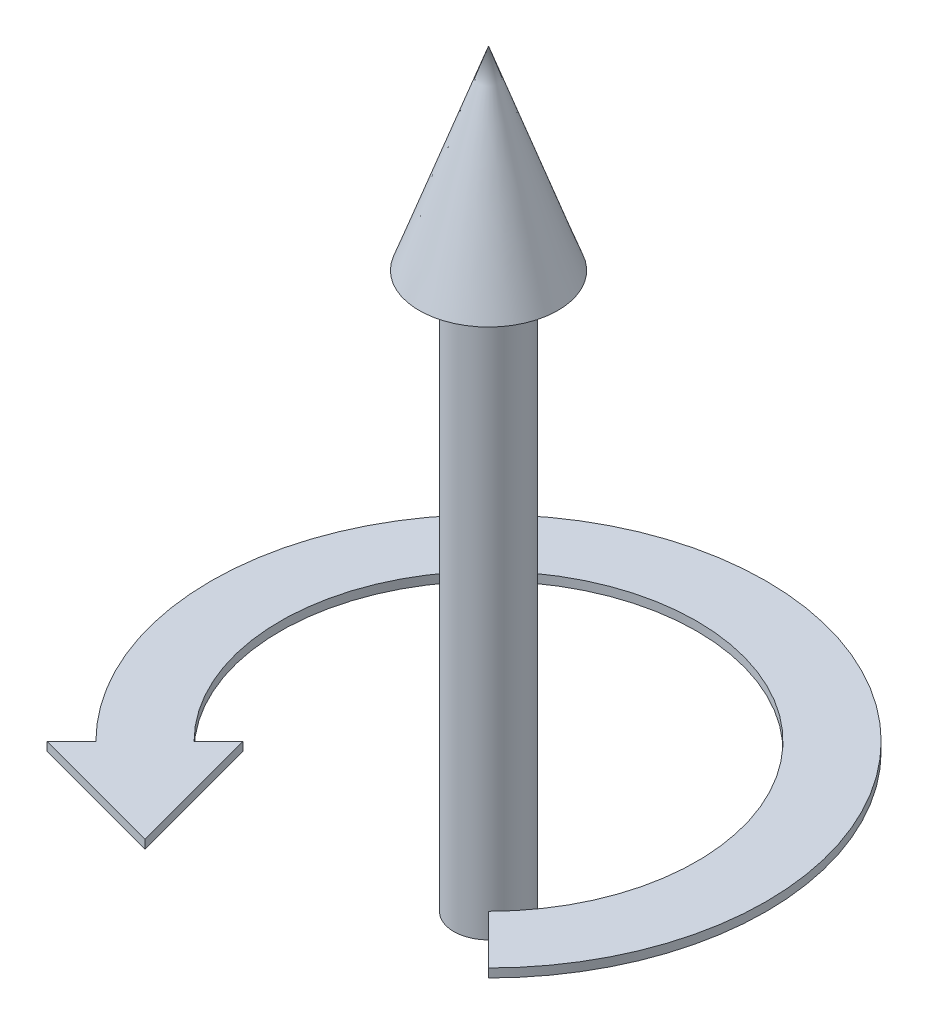
ISO-10303-21;
HEADER;
FILE_DESCRIPTION(('STEP AP214'),'2;1');
FILE_NAME('part.step','',(''),(''),'','','');
FILE_SCHEMA(('AUTOMOTIVE_DESIGN { 1 0 10303 214 1 1 1 1 }'));
ENDSEC;
DATA;
#1=APPLICATION_CONTEXT('core data for automotive mechanical design processes');
#2=APPLICATION_PROTOCOL_DEFINITION('international standard','automotive_design',2000,#1);
#3=PRODUCT_CONTEXT('',#1,'mechanical');
#4=PRODUCT('Part','Part','',(#3));
#5=PRODUCT_RELATED_PRODUCT_CATEGORY('part','',(#4));
#6=PRODUCT_DEFINITION_FORMATION('','',#4);
#7=PRODUCT_DEFINITION_CONTEXT('part definition',#1,'design');
#8=PRODUCT_DEFINITION('design','',#6,#7);
#9=PRODUCT_DEFINITION_SHAPE('','',#8);
#10=(LENGTH_UNIT() NAMED_UNIT(*) SI_UNIT(.MILLI.,.METRE.));
#11=(NAMED_UNIT(*) PLANE_ANGLE_UNIT() SI_UNIT($,.RADIAN.));
#12=(NAMED_UNIT(*) SI_UNIT($,.STERADIAN.) SOLID_ANGLE_UNIT());
#13=UNCERTAINTY_MEASURE_WITH_UNIT(LENGTH_MEASURE(1.E-05),#10,'distance_accuracy_value','');
#14=(GEOMETRIC_REPRESENTATION_CONTEXT(3) GLOBAL_UNCERTAINTY_ASSIGNED_CONTEXT((#13)) GLOBAL_UNIT_ASSIGNED_CONTEXT((#10,
#11,#12)) REPRESENTATION_CONTEXT('',''));
#15=CARTESIAN_POINT('',(0.,0.,0.));
#16=DIRECTION('',(0.,0.,1.));
#17=DIRECTION('',(1.,0.,0.));
#18=AXIS2_PLACEMENT_3D('',#15,#16,#17);
#19=CARTESIAN_POINT('',(0.,6.746875,0.));
#20=DIRECTION('',(0.,-1.,0.));
#21=DIRECTION('',(0.,0.,-1.));
#22=AXIS2_PLACEMENT_3D('',#19,#20,#21);
#23=CYLINDRICAL_SURFACE('',#22,9.525);
#24=CARTESIAN_POINT('',(0.,6.35,0.));
#25=DIRECTION('',(0.,1.,0.));
#26=DIRECTION('',(0.,0.,-1.));
#27=AXIS2_PLACEMENT_3D('',#24,#25,#26);
#28=CIRCLE('',#27,9.525);
#29=CARTESIAN_POINT('',(6.73519209080188,6.35,6.73519209080185));
#30=VERTEX_POINT('',#29);
#31=CARTESIAN_POINT('',(-6.73519209080183,6.35,6.7351920908019));
#32=VERTEX_POINT('',#31);
#33=EDGE_CURVE('E139',#30,#32,#28,.T.);
#34=ORIENTED_EDGE('',*,*,#33,.F.);
#35=DIRECTION('',(0.,-1.,0.));
#36=VECTOR('',#35,1.);
#37=CARTESIAN_POINT('',(6.73519209080188,6.746875,6.73519209080185));
#38=LINE('',#37,#36);
#39=CARTESIAN_POINT('',(6.73519209080188,6.746875,6.73519209080185));
#40=VERTEX_POINT('',#39);
#41=EDGE_CURVE('E12',#40,#30,#38,.T.);
#42=ORIENTED_EDGE('',*,*,#41,.F.);
#43=CARTESIAN_POINT('',(0.,6.746875,0.));
#44=DIRECTION('',(0.,1.,0.));
#45=DIRECTION('',(0.,0.,-1.));
#46=AXIS2_PLACEMENT_3D('',#43,#44,#45);
#47=CIRCLE('',#46,9.525);
#48=CARTESIAN_POINT('',(-6.73519209080183,6.746875,6.7351920908019));
#49=VERTEX_POINT('',#48);
#50=EDGE_CURVE('E156',#40,#49,#47,.T.);
#51=ORIENTED_EDGE('',*,*,#50,.T.);
#52=DIRECTION('',(0.,-1.,0.));
#53=VECTOR('',#52,1.);
#54=CARTESIAN_POINT('',(-6.73519209080183,6.746875,6.7351920908019));
#55=LINE('',#54,#53);
#56=EDGE_CURVE('E51',#49,#32,#55,.T.);
#57=ORIENTED_EDGE('',*,*,#56,.T.);
#58=EDGE_LOOP('',(#34,#42,#51,#57));
#59=FACE_BOUND('',#58,.T.);
#60=ADVANCED_FACE('F48',(#59),#23,.F.);
#61=CARTESIAN_POINT('',(6.73519209080188,6.746875,6.73519209080185));
#62=DIRECTION('',(-0.707106781186546,0.,0.707106781186548));
#63=DIRECTION('',(0.707106781186549,0.,0.707106781186547));
#64=AXIS2_PLACEMENT_3D('',#61,#62,#63);
#65=PLANE('',#64);
#66=DIRECTION('',(-0.707106781186549,0.,-0.707106781186546));
#67=VECTOR('',#66,1.);
#68=CARTESIAN_POINT('',(6.73519209080188,6.35,6.73519209080185));
#69=LINE('',#68,#67);
#70=CARTESIAN_POINT('',(8.98025612106917,6.35,8.98025612106914));
#71=VERTEX_POINT('',#70);
#72=EDGE_CURVE('E154',#71,#30,#69,.T.);
#73=ORIENTED_EDGE('',*,*,#72,.F.);
#74=DIRECTION('',(0.,-1.,0.));
#75=VECTOR('',#74,1.);
#76=CARTESIAN_POINT('',(8.98025612106917,6.746875,8.98025612106914));
#77=LINE('',#76,#75);
#78=CARTESIAN_POINT('',(8.98025612106917,6.746875,8.98025612106914));
#79=VERTEX_POINT('',#78);
#80=EDGE_CURVE('E57',#79,#71,#77,.T.);
#81=ORIENTED_EDGE('',*,*,#80,.F.);
#82=DIRECTION('',(-0.707106781186549,0.,-0.707106781186546));
#83=VECTOR('',#82,1.);
#84=CARTESIAN_POINT('',(6.73519209080188,6.746875,6.73519209080185));
#85=LINE('',#84,#83);
#86=EDGE_CURVE('E129',#79,#40,#85,.T.);
#87=ORIENTED_EDGE('',*,*,#86,.T.);
#88=ORIENTED_EDGE('',*,*,#41,.T.);
#89=EDGE_LOOP('',(#73,#81,#87,#88));
#90=FACE_BOUND('',#89,.T.);
#91=ADVANCED_FACE('F166',(#90),#65,.T.);
#92=CARTESIAN_POINT('',(0.,6.746875,0.));
#93=DIRECTION('',(0.,-1.,0.));
#94=DIRECTION('',(0.,0.,-1.));
#95=AXIS2_PLACEMENT_3D('',#92,#93,#94);
#96=CYLINDRICAL_SURFACE('',#95,12.7);
#97=CARTESIAN_POINT('',(0.,6.35,0.));
#98=DIRECTION('',(0.,-1.,0.));
#99=DIRECTION('',(0.,0.,-1.));
#100=AXIS2_PLACEMENT_3D('',#97,#98,#99);
#101=CIRCLE('',#100,12.7);
#102=CARTESIAN_POINT('',(-8.98025612106911,6.35,8.9802561210692));
#103=VERTEX_POINT('',#102);
#104=EDGE_CURVE('E116',#103,#71,#101,.T.);
#105=ORIENTED_EDGE('',*,*,#104,.F.);
#106=DIRECTION('',(0.,-1.,0.));
#107=VECTOR('',#106,1.);
#108=CARTESIAN_POINT('',(-8.98025612106911,6.746875,8.9802561210692));
#109=LINE('',#108,#107);
#110=CARTESIAN_POINT('',(-8.98025612106911,6.746875,8.9802561210692));
#111=VERTEX_POINT('',#110);
#112=EDGE_CURVE('E111',#111,#103,#109,.T.);
#113=ORIENTED_EDGE('',*,*,#112,.F.);
#114=CARTESIAN_POINT('',(0.,6.746875,0.));
#115=DIRECTION('',(0.,-1.,0.));
#116=DIRECTION('',(0.,0.,-1.));
#117=AXIS2_PLACEMENT_3D('',#114,#115,#116);
#118=CIRCLE('',#117,12.7);
#119=EDGE_CURVE('E114',#111,#79,#118,.T.);
#120=ORIENTED_EDGE('',*,*,#119,.T.);
#121=ORIENTED_EDGE('',*,*,#80,.T.);
#122=EDGE_LOOP('',(#105,#113,#120,#121));
#123=FACE_BOUND('',#122,.T.);
#124=ADVANCED_FACE('F113',(#123),#96,.T.);
#125=CARTESIAN_POINT('',(-10.1027881362027,6.746875,10.1027881362028));
#126=DIRECTION('',(-0.70710678118655,0.,-0.707106781186545));
#127=DIRECTION('',(-0.707106781186545,0.,0.70710678118655));
#128=AXIS2_PLACEMENT_3D('',#125,#126,#127);
#129=PLANE('',#128);
#130=DIRECTION('',(0.707106781186545,0.,-0.70710678118655));
#131=VECTOR('',#130,1.);
#132=CARTESIAN_POINT('',(-10.1027881362027,6.35,10.1027881362028));
#133=LINE('',#132,#131);
#134=CARTESIAN_POINT('',(-10.1027881362027,6.35,10.1027881362028));
#135=VERTEX_POINT('',#134);
#136=EDGE_CURVE('E151',#135,#103,#133,.T.);
#137=ORIENTED_EDGE('',*,*,#136,.F.);
#138=DIRECTION('',(0.,-1.,0.));
#139=VECTOR('',#138,1.);
#140=CARTESIAN_POINT('',(-10.1027881362027,6.746875,10.1027881362028));
#141=LINE('',#140,#139);
#142=CARTESIAN_POINT('',(-10.1027881362027,6.746875,10.1027881362028));
#143=VERTEX_POINT('',#142);
#144=EDGE_CURVE('E121',#143,#135,#141,.T.);
#145=ORIENTED_EDGE('',*,*,#144,.F.);
#146=DIRECTION('',(0.707106781186545,0.,-0.70710678118655));
#147=VECTOR('',#146,1.);
#148=CARTESIAN_POINT('',(-10.1027881362027,6.746875,10.1027881362028));
#149=LINE('',#148,#147);
#150=EDGE_CURVE('E127',#143,#111,#149,.T.);
#151=ORIENTED_EDGE('',*,*,#150,.T.);
#152=ORIENTED_EDGE('',*,*,#112,.T.);
#153=EDGE_LOOP('',(#137,#145,#151,#152));
#154=FACE_BOUND('',#153,.T.);
#155=ADVANCED_FACE('F131',(#154),#129,.T.);
#156=CARTESIAN_POINT('',(-3.96915913926719,6.746875,11.7462890726038));
#157=DIRECTION('',(-0.258819045102511,0.,0.965925826289071));
#158=DIRECTION('',(0.965925826289071,0.,0.258819045102511));
#159=AXIS2_PLACEMENT_3D('',#156,#157,#158);
#160=PLANE('',#159);
#161=DIRECTION('',(-0.965925826289071,0.,-0.258819045102511));
#162=VECTOR('',#161,1.);
#163=CARTESIAN_POINT('',(-3.96915913926719,6.35,11.7462890726038));
#164=LINE('',#163,#162);
#165=CARTESIAN_POINT('',(-3.96915913926719,6.35,11.7462890726038));
#166=VERTEX_POINT('',#165);
#167=EDGE_CURVE('E148',#166,#135,#164,.T.);
#168=ORIENTED_EDGE('',*,*,#167,.F.);
#169=DIRECTION('',(0.,-1.,0.));
#170=VECTOR('',#169,1.);
#171=CARTESIAN_POINT('',(-3.96915913926719,6.746875,11.7462890726038));
#172=LINE('',#171,#170);
#173=CARTESIAN_POINT('',(-3.96915913926719,6.746875,11.7462890726038));
#174=VERTEX_POINT('',#173);
#175=EDGE_CURVE('E160',#174,#166,#172,.T.);
#176=ORIENTED_EDGE('',*,*,#175,.F.);
#177=DIRECTION('',(-0.965925826289071,0.,-0.258819045102511));
#178=VECTOR('',#177,1.);
#179=CARTESIAN_POINT('',(-3.96915913926719,6.746875,11.7462890726038));
#180=LINE('',#179,#178);
#181=EDGE_CURVE('E132',#174,#143,#180,.T.);
#182=ORIENTED_EDGE('',*,*,#181,.T.);
#183=ORIENTED_EDGE('',*,*,#144,.T.);
#184=EDGE_LOOP('',(#168,#176,#182,#183));
#185=FACE_BOUND('',#184,.T.);
#186=ADVANCED_FACE('F179',(#185),#160,.T.);
#187=CARTESIAN_POINT('',(-5.61266007566819,6.746875,5.61266007566825));
#188=DIRECTION('',(0.965925826289068,0.,-0.258819045102521));
#189=DIRECTION('',(-0.258819045102521,0.,-0.965925826289068));
#190=AXIS2_PLACEMENT_3D('',#187,#188,#189);
#191=PLANE('',#190);
#192=DIRECTION('',(0.258819045102521,0.,0.965925826289068));
#193=VECTOR('',#192,1.);
#194=CARTESIAN_POINT('',(-5.61266007566819,6.35,5.61266007566825));
#195=LINE('',#194,#193);
#196=CARTESIAN_POINT('',(-5.61266007566819,6.35,5.61266007566825));
#197=VERTEX_POINT('',#196);
#198=EDGE_CURVE('E145',#197,#166,#195,.T.);
#199=ORIENTED_EDGE('',*,*,#198,.F.);
#200=DIRECTION('',(0.,-1.,0.));
#201=VECTOR('',#200,1.);
#202=CARTESIAN_POINT('',(-5.61266007566819,6.746875,5.61266007566825));
#203=LINE('',#202,#201);
#204=CARTESIAN_POINT('',(-5.61266007566819,6.746875,5.61266007566825));
#205=VERTEX_POINT('',#204);
#206=EDGE_CURVE('E161',#205,#197,#203,.T.);
#207=ORIENTED_EDGE('',*,*,#206,.F.);
#208=DIRECTION('',(0.258819045102521,0.,0.965925826289068));
#209=VECTOR('',#208,1.);
#210=CARTESIAN_POINT('',(-5.61266007566819,6.746875,5.61266007566825));
#211=LINE('',#210,#209);
#212=EDGE_CURVE('E134',#205,#174,#211,.T.);
#213=ORIENTED_EDGE('',*,*,#212,.T.);
#214=ORIENTED_EDGE('',*,*,#175,.T.);
#215=EDGE_LOOP('',(#199,#207,#213,#214));
#216=FACE_BOUND('',#215,.T.);
#217=ADVANCED_FACE('F182',(#216),#191,.T.);
#218=CARTESIAN_POINT('',(-6.73519209080183,6.746875,6.7351920908019));
#219=DIRECTION('',(-0.707106781186552,0.,-0.707106781186543));
#220=DIRECTION('',(-0.707106781186543,0.,0.707106781186552));
#221=AXIS2_PLACEMENT_3D('',#218,#219,#220);
#222=PLANE('',#221);
#223=DIRECTION('',(0.707106781186543,0.,-0.707106781186552));
#224=VECTOR('',#223,1.);
#225=CARTESIAN_POINT('',(-6.73519209080183,6.35,6.7351920908019));
#226=LINE('',#225,#224);
#227=EDGE_CURVE('E142',#32,#197,#226,.T.);
#228=ORIENTED_EDGE('',*,*,#227,.F.);
#229=ORIENTED_EDGE('',*,*,#56,.F.);
#230=DIRECTION('',(0.707106781186543,0.,-0.707106781186552));
#231=VECTOR('',#230,1.);
#232=CARTESIAN_POINT('',(-6.73519209080183,6.746875,6.7351920908019));
#233=LINE('',#232,#231);
#234=EDGE_CURVE('E244',#49,#205,#233,.T.);
#235=ORIENTED_EDGE('',*,*,#234,.T.);
#236=ORIENTED_EDGE('',*,*,#206,.T.);
#237=EDGE_LOOP('',(#228,#229,#235,#236));
#238=FACE_BOUND('',#237,.T.);
#239=ADVANCED_FACE('F163',(#238),#222,.T.);
#240=CARTESIAN_POINT('',(0.,6.746875,0.));
#241=DIRECTION('',(0.,-1.,0.));
#242=DIRECTION('',(0.,0.,-1.));
#243=AXIS2_PLACEMENT_3D('',#240,#241,#242);
#244=PLANE('',#243);
#245=ORIENTED_EDGE('',*,*,#50,.F.);
#246=ORIENTED_EDGE('',*,*,#86,.F.);
#247=ORIENTED_EDGE('',*,*,#119,.F.);
#248=ORIENTED_EDGE('',*,*,#150,.F.);
#249=ORIENTED_EDGE('',*,*,#181,.F.);
#250=ORIENTED_EDGE('',*,*,#212,.F.);
#251=ORIENTED_EDGE('',*,*,#234,.F.);
#252=EDGE_LOOP('',(#245,#246,#247,#248,#249,#250,#251));
#253=FACE_BOUND('',#252,.T.);
#254=ADVANCED_FACE('F125',(#253),#244,.F.);
#255=CARTESIAN_POINT('',(0.,6.35,0.));
#256=DIRECTION('',(0.,-1.,0.));
#257=DIRECTION('',(0.,0.,-1.));
#258=AXIS2_PLACEMENT_3D('',#255,#256,#257);
#259=PLANE('',#258);
#260=ORIENTED_EDGE('',*,*,#33,.T.);
#261=ORIENTED_EDGE('',*,*,#227,.T.);
#262=ORIENTED_EDGE('',*,*,#198,.T.);
#263=ORIENTED_EDGE('',*,*,#167,.T.);
#264=ORIENTED_EDGE('',*,*,#136,.T.);
#265=ORIENTED_EDGE('',*,*,#104,.T.);
#266=ORIENTED_EDGE('',*,*,#72,.T.);
#267=EDGE_LOOP('',(#260,#261,#262,#263,#264,#265,#266));
#268=FACE_BOUND('',#267,.T.);
#269=ADVANCED_FACE('F165',(#268),#259,.T.);
#270=CLOSED_SHELL('',(#60,#91,#124,#155,#186,#217,#239,#254,#269));
#271=MANIFOLD_SOLID_BREP('B2',#270);
#272=CARTESIAN_POINT('',(0.,25.4,0.));
#273=DIRECTION('',(0.,-1.,0.));
#274=DIRECTION('',(0.,0.,-1.));
#275=AXIS2_PLACEMENT_3D('',#272,#273,#274);
#276=CYLINDRICAL_SURFACE('',#275,1.5875);
#277=CARTESIAN_POINT('',(0.,25.4,0.));
#278=DIRECTION('',(0.,1.,0.));
#279=DIRECTION('',(0.,0.,1.));
#280=AXIS2_PLACEMENT_3D('',#277,#278,#279);
#281=CIRCLE('',#280,1.5875);
#282=CARTESIAN_POINT('',(0.,25.4,1.5875));
#283=VERTEX_POINT('',#282);
#284=EDGE_CURVE('E46',#283,#283,#281,.T.);
#285=ORIENTED_EDGE('',*,*,#284,.F.);
#286=EDGE_LOOP('',(#285));
#287=FACE_BOUND('',#286,.T.);
#288=CARTESIAN_POINT('',(0.,0.,0.));
#289=DIRECTION('',(0.,1.,0.));
#290=DIRECTION('',(0.,0.,1.));
#291=AXIS2_PLACEMENT_3D('',#288,#289,#290);
#292=CIRCLE('',#291,1.5875);
#293=CARTESIAN_POINT('',(0.,0.,1.5875));
#294=VERTEX_POINT('',#293);
#295=EDGE_CURVE('E252',#294,#294,#292,.T.);
#296=ORIENTED_EDGE('',*,*,#295,.T.);
#297=EDGE_LOOP('',(#296));
#298=FACE_BOUND('',#297,.T.);
#299=ADVANCED_FACE('F249',(#287,#298),#276,.T.);
#300=CARTESIAN_POINT('',(0.,0.,0.));
#301=DIRECTION('',(0.,1.,0.));
#302=DIRECTION('',(0.,0.,1.));
#303=AXIS2_PLACEMENT_3D('',#300,#301,#302);
#304=PLANE('',#303);
#305=ORIENTED_EDGE('',*,*,#295,.F.);
#306=EDGE_LOOP('',(#305));
#307=FACE_BOUND('',#306,.T.);
#308=ADVANCED_FACE('F272',(#307),#304,.F.);
#309=CARTESIAN_POINT('',(3.175,25.4,0.));
#310=DIRECTION('',(0.,-1.,0.));
#311=DIRECTION('',(0.,0.,-1.));
#312=AXIS2_PLACEMENT_3D('',#309,#310,#311);
#313=PLANE('',#312);
#314=ORIENTED_EDGE('',*,*,#284,.T.);
#315=EDGE_LOOP('',(#314));
#316=FACE_BOUND('',#315,.T.);
#317=CARTESIAN_POINT('',(0.,25.4,0.));
#318=DIRECTION('',(0.,-1.,0.));
#319=DIRECTION('',(0.,0.,-1.));
#320=AXIS2_PLACEMENT_3D('',#317,#318,#319);
#321=CIRCLE('',#320,3.175);
#322=CARTESIAN_POINT('',(0.,25.4,-3.175));
#323=VERTEX_POINT('',#322);
#324=EDGE_CURVE('E265',#323,#323,#321,.T.);
#325=ORIENTED_EDGE('',*,*,#324,.T.);
#326=EDGE_LOOP('',(#325));
#327=FACE_BOUND('',#326,.T.);
#328=ADVANCED_FACE('F261',(#316,#327),#313,.T.);
#329=CARTESIAN_POINT('',(0.,25.4,0.));
#330=DIRECTION('',(0.,-1.,0.));
#331=DIRECTION('',(0.,0.,-1.));
#332=AXIS2_PLACEMENT_3D('',#329,#330,#331);
#333=CONICAL_SURFACE('',#332,3.175,0.343023940420703);
#334=CARTESIAN_POINT('',(0.,34.29,0.));
#335=VERTEX_POINT('',#334);
#336=VERTEX_LOOP('',#335);
#337=FACE_BOUND('',#336,.T.);
#338=ORIENTED_EDGE('',*,*,#324,.F.);
#339=EDGE_LOOP('',(#338));
#340=FACE_BOUND('',#339,.T.);
#341=ADVANCED_FACE('F258',(#337,#340),#333,.T.);
#342=CLOSED_SHELL('',(#299,#308,#328,#341));
#343=MANIFOLD_SOLID_BREP('B6',#342);
#344=ADVANCED_BREP_SHAPE_REPRESENTATION('',(#18,#271,#343),#14);
#345=SHAPE_DEFINITION_REPRESENTATION(#9,#344);
ENDSEC;
END-ISO-10303-21;
